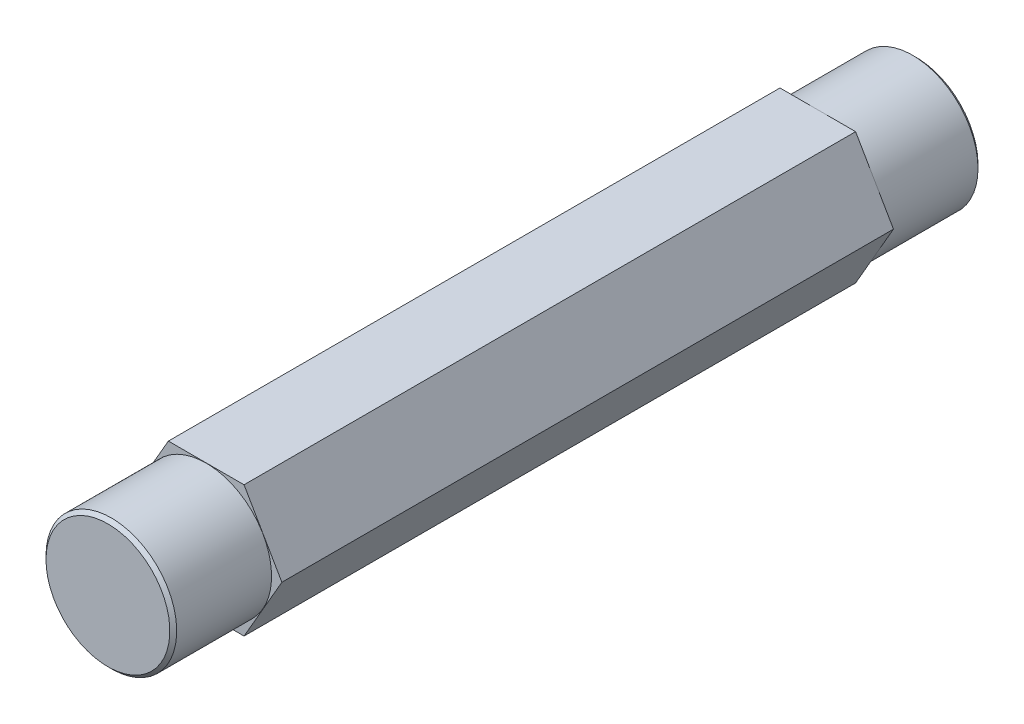
ISO-10303-21;
HEADER;
FILE_DESCRIPTION(('STEP AP214'),'2;1');
FILE_NAME('part.step','',(''),(''),'','','');
FILE_SCHEMA(('AUTOMOTIVE_DESIGN { 1 0 10303 214 1 1 1 1 }'));
ENDSEC;
DATA;
#1=APPLICATION_CONTEXT('core data for automotive mechanical design processes');
#2=APPLICATION_PROTOCOL_DEFINITION('international standard','automotive_design',2000,#1);
#3=PRODUCT_CONTEXT('',#1,'mechanical');
#4=PRODUCT('Part','Part','',(#3));
#5=PRODUCT_RELATED_PRODUCT_CATEGORY('part','',(#4));
#6=PRODUCT_DEFINITION_FORMATION('','',#4);
#7=PRODUCT_DEFINITION_CONTEXT('part definition',#1,'design');
#8=PRODUCT_DEFINITION('design','',#6,#7);
#9=PRODUCT_DEFINITION_SHAPE('','',#8);
#10=(LENGTH_UNIT() NAMED_UNIT(*) SI_UNIT(.MILLI.,.METRE.));
#11=(NAMED_UNIT(*) PLANE_ANGLE_UNIT() SI_UNIT($,.RADIAN.));
#12=(NAMED_UNIT(*) SI_UNIT($,.STERADIAN.) SOLID_ANGLE_UNIT());
#13=UNCERTAINTY_MEASURE_WITH_UNIT(LENGTH_MEASURE(1.E-05),#10,'distance_accuracy_value','');
#14=(GEOMETRIC_REPRESENTATION_CONTEXT(3) GLOBAL_UNCERTAINTY_ASSIGNED_CONTEXT((#13)) GLOBAL_UNIT_ASSIGNED_CONTEXT((#10,
#11,#12)) REPRESENTATION_CONTEXT('',''));
#15=CARTESIAN_POINT('',(0.,0.,0.));
#16=DIRECTION('',(0.,0.,1.));
#17=DIRECTION('',(1.,0.,0.));
#18=AXIS2_PLACEMENT_3D('',#15,#16,#17);
#19=CARTESIAN_POINT('',(0.,0.,29.36875));
#20=DIRECTION('',(0.,0.,1.));
#21=DIRECTION('',(1.,0.,0.));
#22=AXIS2_PLACEMENT_3D('',#19,#20,#21);
#23=PLANE('',#22);
#24=CARTESIAN_POINT('',(0.,0.,29.3687500000033));
#25=DIRECTION('',(0.,0.,-1.));
#26=DIRECTION('',(-1.,0.,0.));
#27=AXIS2_PLACEMENT_3D('',#24,#25,#26);
#28=CIRCLE('',#27,4.49980000001915);
#29=CARTESIAN_POINT('',(-4.49980000001915,0.,29.3687500000033));
#30=VERTEX_POINT('',#29);
#31=EDGE_CURVE('E19',#30,#30,#28,.T.);
#32=ORIENTED_EDGE('',*,*,#31,.F.);
#33=EDGE_LOOP('',(#32));
#34=FACE_BOUND('',#33,.T.);
#35=ADVANCED_FACE('F16',(#34),#23,.T.);
#36=CARTESIAN_POINT('',(0.,0.,-29.36875));
#37=DIRECTION('',(0.,0.,-1.));
#38=DIRECTION('',(-1.,0.,0.));
#39=AXIS2_PLACEMENT_3D('',#36,#37,#38);
#40=PLANE('',#39);
#41=CARTESIAN_POINT('',(0.,0.,-29.3687499999464));
#42=DIRECTION('',(0.,0.,1.));
#43=DIRECTION('',(0.,-1.,0.));
#44=AXIS2_PLACEMENT_3D('',#41,#42,#43);
#45=CIRCLE('',#44,4.49980000007599);
#46=CARTESIAN_POINT('',(0.,-4.49980000007599,-29.3687499999464));
#47=VERTEX_POINT('',#46);
#48=EDGE_CURVE('E108',#47,#47,#45,.T.);
#49=ORIENTED_EDGE('',*,*,#48,.F.);
#50=EDGE_LOOP('',(#49));
#51=FACE_BOUND('',#50,.T.);
#52=ADVANCED_FACE('F124',(#51),#40,.T.);
#53=CARTESIAN_POINT('',(0.,0.,29.118750000066));
#54=DIRECTION('',(0.,0.,-1.));
#55=DIRECTION('',(-1.,0.,0.));
#56=AXIS2_PLACEMENT_3D('',#53,#54,#55);
#57=CONICAL_SURFACE('',#56,4.74979999995639,0.785398163397448);
#58=CARTESIAN_POINT('',(0.,0.,29.11875));
#59=DIRECTION('',(0.,0.,-1.));
#60=DIRECTION('',(-1.,0.,0.));
#61=AXIS2_PLACEMENT_3D('',#58,#59,#60);
#62=CIRCLE('',#61,4.7498);
#63=CARTESIAN_POINT('',(-4.7498,0.,29.11875));
#64=VERTEX_POINT('',#63);
#65=EDGE_CURVE('E105',#64,#64,#62,.T.);
#66=ORIENTED_EDGE('',*,*,#65,.F.);
#67=EDGE_LOOP('',(#66));
#68=FACE_BOUND('',#67,.T.);
#69=ORIENTED_EDGE('',*,*,#31,.T.);
#70=EDGE_LOOP('',(#69));
#71=FACE_BOUND('',#70,.T.);
#72=ADVANCED_FACE('F121',(#68,#71),#57,.T.);
#73=CARTESIAN_POINT('',(0.,0.,-29.1187500001229));
#74=DIRECTION('',(0.,0.,1.));
#75=DIRECTION('',(0.,-1.,0.));
#76=AXIS2_PLACEMENT_3D('',#73,#74,#75);
#77=CONICAL_SURFACE('',#76,4.74979999984271,0.785398163283761);
#78=CARTESIAN_POINT('',(0.,0.,-29.11875));
#79=DIRECTION('',(0.,0.,1.));
#80=DIRECTION('',(1.,0.,0.));
#81=AXIS2_PLACEMENT_3D('',#78,#79,#80);
#82=CIRCLE('',#81,4.7498);
#83=CARTESIAN_POINT('',(4.7498,0.,-29.11875));
#84=VERTEX_POINT('',#83);
#85=EDGE_CURVE('E102',#84,#84,#82,.T.);
#86=ORIENTED_EDGE('',*,*,#85,.F.);
#87=EDGE_LOOP('',(#86));
#88=FACE_BOUND('',#87,.T.);
#89=ORIENTED_EDGE('',*,*,#48,.T.);
#90=EDGE_LOOP('',(#89));
#91=FACE_BOUND('',#90,.T.);
#92=ADVANCED_FACE('F168',(#88,#91),#77,.T.);
#93=CARTESIAN_POINT('',(0.,0.,29.36875));
#94=DIRECTION('',(0.,0.,-1.));
#95=DIRECTION('',(-1.,0.,0.));
#96=AXIS2_PLACEMENT_3D('',#93,#94,#95);
#97=CYLINDRICAL_SURFACE('',#96,4.7498);
#98=CARTESIAN_POINT('',(0.,0.,22.225));
#99=DIRECTION('',(0.,0.,-1.));
#100=DIRECTION('',(-1.,0.,0.));
#101=AXIS2_PLACEMENT_3D('',#98,#99,#100);
#102=CIRCLE('',#101,4.7498);
#103=CARTESIAN_POINT('',(-4.7498,0.,22.225));
#104=VERTEX_POINT('',#103);
#105=EDGE_CURVE('E90',#104,#104,#102,.T.);
#106=ORIENTED_EDGE('',*,*,#105,.F.);
#107=EDGE_LOOP('',(#106));
#108=FACE_BOUND('',#107,.T.);
#109=ORIENTED_EDGE('',*,*,#65,.T.);
#110=EDGE_LOOP('',(#109));
#111=FACE_BOUND('',#110,.T.);
#112=ADVANCED_FACE('F164',(#108,#111),#97,.T.);
#113=CARTESIAN_POINT('',(0.,0.,-29.36875));
#114=DIRECTION('',(0.,0.,1.));
#115=DIRECTION('',(1.,0.,0.));
#116=AXIS2_PLACEMENT_3D('',#113,#114,#115);
#117=CYLINDRICAL_SURFACE('',#116,4.7498);
#118=CARTESIAN_POINT('',(0.,0.,-22.225));
#119=DIRECTION('',(0.,0.,1.));
#120=DIRECTION('',(1.,0.,0.));
#121=AXIS2_PLACEMENT_3D('',#118,#119,#120);
#122=CIRCLE('',#121,4.7498);
#123=CARTESIAN_POINT('',(4.7498,0.,-22.225));
#124=VERTEX_POINT('',#123);
#125=EDGE_CURVE('E109',#124,#124,#122,.F.);
#126=ORIENTED_EDGE('',*,*,#125,.T.);
#127=EDGE_LOOP('',(#126));
#128=FACE_BOUND('',#127,.T.);
#129=ORIENTED_EDGE('',*,*,#85,.T.);
#130=EDGE_LOOP('',(#129));
#131=FACE_BOUND('',#130,.T.);
#132=ADVANCED_FACE('F160',(#128,#131),#117,.T.);
#133=CARTESIAN_POINT('',(-2.7496306570156,4.76250000000003,22.225));
#134=DIRECTION('',(0.866025403784439,-0.5,0.));
#135=DIRECTION('',(0.5,0.866025403784439,0.));
#136=AXIS2_PLACEMENT_3D('',#133,#134,#135);
#137=PLANE('',#136);
#138=DIRECTION('',(0.,0.,1.));
#139=VECTOR('',#138,1.);
#140=CARTESIAN_POINT('',(-5.49926131403121,0.,22.225));
#141=LINE('',#140,#139);
#142=CARTESIAN_POINT('',(-5.49926131403121,0.,-22.225));
#143=VERTEX_POINT('',#142);
#144=CARTESIAN_POINT('',(-5.49926131403121,0.,22.225));
#145=VERTEX_POINT('',#144);
#146=EDGE_CURVE('E100',#143,#145,#141,.T.);
#147=ORIENTED_EDGE('',*,*,#146,.T.);
#148=DIRECTION('',(-0.5,-0.866025403784439,0.));
#149=VECTOR('',#148,1.);
#150=CARTESIAN_POINT('',(-2.7496306570156,4.76250000000003,22.225));
#151=LINE('',#150,#149);
#152=CARTESIAN_POINT('',(-2.7496306570156,4.76250000000003,22.225));
#153=VERTEX_POINT('',#152);
#154=EDGE_CURVE('E65',#153,#145,#151,.T.);
#155=ORIENTED_EDGE('',*,*,#154,.F.);
#156=DIRECTION('',(0.,0.,-1.));
#157=VECTOR('',#156,1.);
#158=CARTESIAN_POINT('',(-2.7496306570156,4.76250000000003,22.225));
#159=LINE('',#158,#157);
#160=CARTESIAN_POINT('',(-2.7496306570156,4.76250000000003,-22.225));
#161=VERTEX_POINT('',#160);
#162=EDGE_CURVE('E112',#153,#161,#159,.T.);
#163=ORIENTED_EDGE('',*,*,#162,.T.);
#164=DIRECTION('',(-0.5,-0.866025403784439,0.));
#165=VECTOR('',#164,1.);
#166=CARTESIAN_POINT('',(-2.7496306570156,4.76250000000003,-22.225));
#167=LINE('',#166,#165);
#168=EDGE_CURVE('E273',#161,#143,#167,.T.);
#169=ORIENTED_EDGE('',*,*,#168,.T.);
#170=EDGE_LOOP('',(#147,#155,#163,#169));
#171=FACE_BOUND('',#170,.T.);
#172=ADVANCED_FACE('F156',(#171),#137,.F.);
#173=CARTESIAN_POINT('',(-5.49926131403121,0.,22.225));
#174=DIRECTION('',(0.866025403784439,0.5,0.));
#175=DIRECTION('',(-0.5,0.866025403784439,0.));
#176=AXIS2_PLACEMENT_3D('',#173,#174,#175);
#177=PLANE('',#176);
#178=DIRECTION('',(0.,0.,1.));
#179=VECTOR('',#178,1.);
#180=CARTESIAN_POINT('',(-2.7496306570156,-4.76250000000002,22.225));
#181=LINE('',#180,#179);
#182=CARTESIAN_POINT('',(-2.7496306570156,-4.76250000000002,-22.225));
#183=VERTEX_POINT('',#182);
#184=CARTESIAN_POINT('',(-2.7496306570156,-4.76250000000002,22.225));
#185=VERTEX_POINT('',#184);
#186=EDGE_CURVE('E82',#183,#185,#181,.T.);
#187=ORIENTED_EDGE('',*,*,#186,.T.);
#188=DIRECTION('',(0.5,-0.866025403784439,0.));
#189=VECTOR('',#188,1.);
#190=CARTESIAN_POINT('',(-5.49926131403121,0.,22.225));
#191=LINE('',#190,#189);
#192=EDGE_CURVE('E88',#145,#185,#191,.T.);
#193=ORIENTED_EDGE('',*,*,#192,.F.);
#194=ORIENTED_EDGE('',*,*,#146,.F.);
#195=DIRECTION('',(0.5,-0.866025403784439,0.));
#196=VECTOR('',#195,1.);
#197=CARTESIAN_POINT('',(-5.49926131403121,0.,-22.225));
#198=LINE('',#197,#196);
#199=EDGE_CURVE('E281',#143,#183,#198,.T.);
#200=ORIENTED_EDGE('',*,*,#199,.T.);
#201=EDGE_LOOP('',(#187,#193,#194,#200));
#202=FACE_BOUND('',#201,.T.);
#203=ADVANCED_FACE('F153',(#202),#177,.F.);
#204=CARTESIAN_POINT('',(-2.7496306570156,-4.76250000000002,22.225));
#205=DIRECTION('',(0.,1.,0.));
#206=DIRECTION('',(0.,0.,1.));
#207=AXIS2_PLACEMENT_3D('',#204,#205,#206);
#208=PLANE('',#207);
#209=DIRECTION('',(0.,0.,1.));
#210=VECTOR('',#209,1.);
#211=CARTESIAN_POINT('',(2.74963065701558,-4.76250000000002,22.225));
#212=LINE('',#211,#210);
#213=CARTESIAN_POINT('',(2.74963065701558,-4.76250000000002,-22.225));
#214=VERTEX_POINT('',#213);
#215=CARTESIAN_POINT('',(2.74963065701558,-4.76250000000002,22.225));
#216=VERTEX_POINT('',#215);
#217=EDGE_CURVE('E71',#214,#216,#212,.T.);
#218=ORIENTED_EDGE('',*,*,#217,.T.);
#219=DIRECTION('',(1.,0.,0.));
#220=VECTOR('',#219,1.);
#221=CARTESIAN_POINT('',(0.,-4.76250000000002,22.225));
#222=LINE('',#221,#220);
#223=EDGE_CURVE('E74',#185,#216,#222,.T.);
#224=ORIENTED_EDGE('',*,*,#223,.F.);
#225=ORIENTED_EDGE('',*,*,#186,.F.);
#226=DIRECTION('',(1.,0.,0.));
#227=VECTOR('',#226,1.);
#228=CARTESIAN_POINT('',(0.,-4.76250000000002,-22.225));
#229=LINE('',#228,#227);
#230=EDGE_CURVE('E76',#183,#214,#229,.T.);
#231=ORIENTED_EDGE('',*,*,#230,.T.);
#232=EDGE_LOOP('',(#218,#224,#225,#231));
#233=FACE_BOUND('',#232,.T.);
#234=ADVANCED_FACE('F73',(#233),#208,.F.);
#235=CARTESIAN_POINT('',(2.74963065701558,-4.76250000000002,22.225));
#236=DIRECTION('',(-0.866025403784439,0.499999999999999,0.));
#237=DIRECTION('',(-0.499999999999999,-0.866025403784439,0.));
#238=AXIS2_PLACEMENT_3D('',#235,#236,#237);
#239=PLANE('',#238);
#240=DIRECTION('',(0.,0.,1.));
#241=VECTOR('',#240,1.);
#242=CARTESIAN_POINT('',(5.49926131403118,0.,22.225));
#243=LINE('',#242,#241);
#244=CARTESIAN_POINT('',(5.49926131403118,0.,-22.225));
#245=VERTEX_POINT('',#244);
#246=CARTESIAN_POINT('',(5.49926131403118,0.,22.225));
#247=VERTEX_POINT('',#246);
#248=EDGE_CURVE('E94',#245,#247,#243,.T.);
#249=ORIENTED_EDGE('',*,*,#248,.T.);
#250=DIRECTION('',(0.499999999999999,0.866025403784439,0.));
#251=VECTOR('',#250,1.);
#252=CARTESIAN_POINT('',(2.74963065701558,-4.76250000000002,22.225));
#253=LINE('',#252,#251);
#254=EDGE_CURVE('E81',#216,#247,#253,.T.);
#255=ORIENTED_EDGE('',*,*,#254,.F.);
#256=ORIENTED_EDGE('',*,*,#217,.F.);
#257=DIRECTION('',(0.499999999999999,0.866025403784439,0.));
#258=VECTOR('',#257,1.);
#259=CARTESIAN_POINT('',(2.74963065701558,-4.76250000000002,-22.225));
#260=LINE('',#259,#258);
#261=EDGE_CURVE('E284',#214,#245,#260,.T.);
#262=ORIENTED_EDGE('',*,*,#261,.T.);
#263=EDGE_LOOP('',(#249,#255,#256,#262));
#264=FACE_BOUND('',#263,.T.);
#265=ADVANCED_FACE('F93',(#264),#239,.F.);
#266=CARTESIAN_POINT('',(0.,0.,22.225));
#267=DIRECTION('',(0.,0.,1.));
#268=DIRECTION('',(1.,0.,0.));
#269=AXIS2_PLACEMENT_3D('',#266,#267,#268);
#270=PLANE('',#269);
#271=ORIENTED_EDGE('',*,*,#105,.T.);
#272=EDGE_LOOP('',(#271));
#273=FACE_BOUND('',#272,.T.);
#274=ORIENTED_EDGE('',*,*,#192,.T.);
#275=ORIENTED_EDGE('',*,*,#223,.T.);
#276=ORIENTED_EDGE('',*,*,#254,.T.);
#277=DIRECTION('',(0.5,-0.866025403784439,0.));
#278=VECTOR('',#277,1.);
#279=CARTESIAN_POINT('',(5.49926131403118,0.,22.225));
#280=LINE('',#279,#278);
#281=CARTESIAN_POINT('',(2.74963065701557,4.76250000000003,22.225));
#282=VERTEX_POINT('',#281);
#283=EDGE_CURVE('E287',#247,#282,#280,.F.);
#284=ORIENTED_EDGE('',*,*,#283,.T.);
#285=DIRECTION('',(1.,0.,0.));
#286=VECTOR('',#285,1.);
#287=CARTESIAN_POINT('',(2.74963065701557,4.76250000000003,22.225));
#288=LINE('',#287,#286);
#289=EDGE_CURVE('E114',#282,#153,#288,.F.);
#290=ORIENTED_EDGE('',*,*,#289,.T.);
#291=ORIENTED_EDGE('',*,*,#154,.T.);
#292=EDGE_LOOP('',(#274,#275,#276,#284,#290,#291));
#293=FACE_BOUND('',#292,.T.);
#294=ADVANCED_FACE('F84',(#273,#293),#270,.T.);
#295=CARTESIAN_POINT('',(2.74963065701557,4.76250000000003,22.225));
#296=DIRECTION('',(0.,-1.,0.));
#297=DIRECTION('',(0.,0.,-1.));
#298=AXIS2_PLACEMENT_3D('',#295,#296,#297);
#299=PLANE('',#298);
#300=ORIENTED_EDGE('',*,*,#162,.F.);
#301=ORIENTED_EDGE('',*,*,#289,.F.);
#302=DIRECTION('',(0.,0.,1.));
#303=VECTOR('',#302,1.);
#304=CARTESIAN_POINT('',(2.74963065701557,4.76250000000003,22.225));
#305=LINE('',#304,#303);
#306=CARTESIAN_POINT('',(2.74963065701557,4.76250000000003,-22.225));
#307=VERTEX_POINT('',#306);
#308=EDGE_CURVE('E25',#282,#307,#305,.F.);
#309=ORIENTED_EDGE('',*,*,#308,.T.);
#310=DIRECTION('',(1.,0.,0.));
#311=VECTOR('',#310,1.);
#312=CARTESIAN_POINT('',(0.,4.76250000000003,-22.225));
#313=LINE('',#312,#311);
#314=EDGE_CURVE('E33',#307,#161,#313,.F.);
#315=ORIENTED_EDGE('',*,*,#314,.T.);
#316=EDGE_LOOP('',(#300,#301,#309,#315));
#317=FACE_BOUND('',#316,.T.);
#318=ADVANCED_FACE('F139',(#317),#299,.F.);
#319=CARTESIAN_POINT('',(0.,0.,-22.225));
#320=DIRECTION('',(0.,0.,1.));
#321=DIRECTION('',(1.,0.,0.));
#322=AXIS2_PLACEMENT_3D('',#319,#320,#321);
#323=PLANE('',#322);
#324=ORIENTED_EDGE('',*,*,#230,.F.);
#325=ORIENTED_EDGE('',*,*,#199,.F.);
#326=ORIENTED_EDGE('',*,*,#168,.F.);
#327=ORIENTED_EDGE('',*,*,#314,.F.);
#328=DIRECTION('',(0.5,-0.866025403784439,0.));
#329=VECTOR('',#328,1.);
#330=CARTESIAN_POINT('',(5.49926131403118,0.,-22.225));
#331=LINE('',#330,#329);
#332=EDGE_CURVE('E11',#307,#245,#331,.T.);
#333=ORIENTED_EDGE('',*,*,#332,.T.);
#334=ORIENTED_EDGE('',*,*,#261,.F.);
#335=EDGE_LOOP('',(#324,#325,#326,#327,#333,#334));
#336=FACE_BOUND('',#335,.T.);
#337=ORIENTED_EDGE('',*,*,#125,.F.);
#338=EDGE_LOOP('',(#337));
#339=FACE_BOUND('',#338,.T.);
#340=ADVANCED_FACE('F132',(#336,#339),#323,.F.);
#341=CARTESIAN_POINT('',(5.49926131403118,0.,22.225));
#342=DIRECTION('',(-0.866025403784439,-0.5,0.));
#343=DIRECTION('',(0.5,-0.866025403784439,0.));
#344=AXIS2_PLACEMENT_3D('',#341,#342,#343);
#345=PLANE('',#344);
#346=ORIENTED_EDGE('',*,*,#308,.F.);
#347=ORIENTED_EDGE('',*,*,#283,.F.);
#348=ORIENTED_EDGE('',*,*,#248,.F.);
#349=ORIENTED_EDGE('',*,*,#332,.F.);
#350=EDGE_LOOP('',(#346,#347,#348,#349));
#351=FACE_BOUND('',#350,.T.);
#352=ADVANCED_FACE('F130',(#351),#345,.F.);
#353=CLOSED_SHELL('',(#35,#52,#72,#92,#112,#132,#172,#203,#234,#265,#294,#318,#340,#352));
#354=MANIFOLD_SOLID_BREP('B1',#353);
#355=ADVANCED_BREP_SHAPE_REPRESENTATION('',(#18,#354),#14);
#356=SHAPE_DEFINITION_REPRESENTATION(#9,#355);
ENDSEC;
END-ISO-10303-21;
